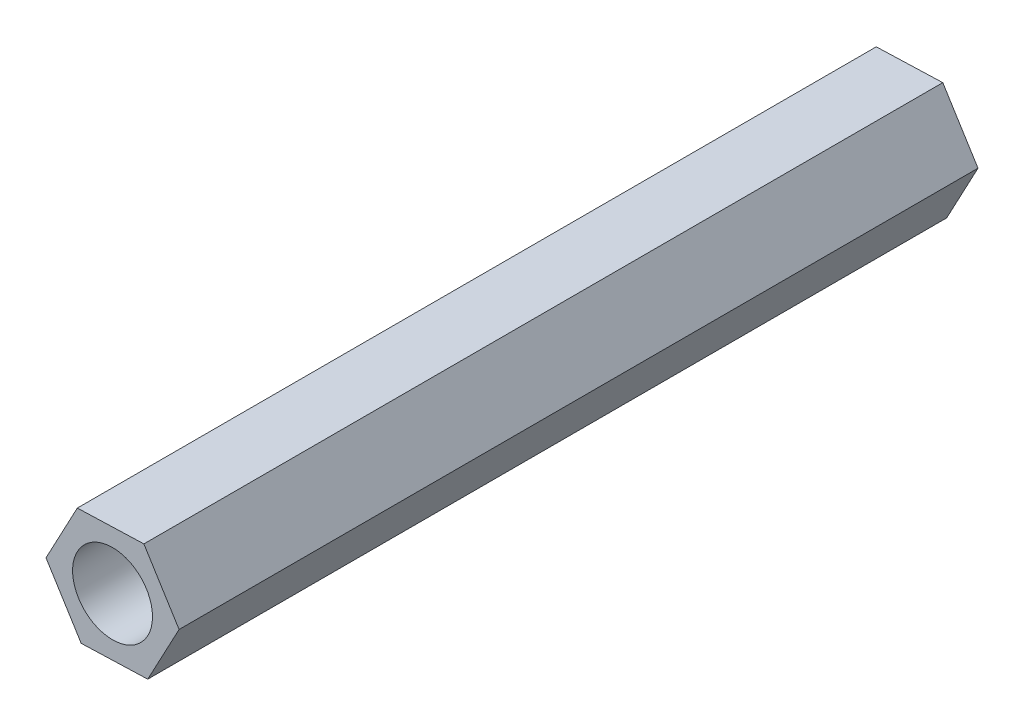
ISO-10303-21;
HEADER;
FILE_DESCRIPTION(('STEP AP214'),'2;1');
FILE_NAME('part.step','',(''),(''),'','','');
FILE_SCHEMA(('AUTOMOTIVE_DESIGN { 1 0 10303 214 1 1 1 1 }'));
ENDSEC;
DATA;
#1=APPLICATION_CONTEXT('core data for automotive mechanical design processes');
#2=APPLICATION_PROTOCOL_DEFINITION('international standard','automotive_design',2000,#1);
#3=PRODUCT_CONTEXT('',#1,'mechanical');
#4=PRODUCT('Part','Part','',(#3));
#5=PRODUCT_RELATED_PRODUCT_CATEGORY('part','',(#4));
#6=PRODUCT_DEFINITION_FORMATION('','',#4);
#7=PRODUCT_DEFINITION_CONTEXT('part definition',#1,'design');
#8=PRODUCT_DEFINITION('design','',#6,#7);
#9=PRODUCT_DEFINITION_SHAPE('','',#8);
#10=(LENGTH_UNIT() NAMED_UNIT(*) SI_UNIT(.MILLI.,.METRE.));
#11=(NAMED_UNIT(*) PLANE_ANGLE_UNIT() SI_UNIT($,.RADIAN.));
#12=(NAMED_UNIT(*) SI_UNIT($,.STERADIAN.) SOLID_ANGLE_UNIT());
#13=UNCERTAINTY_MEASURE_WITH_UNIT(LENGTH_MEASURE(1.E-05),#10,'distance_accuracy_value','');
#14=(GEOMETRIC_REPRESENTATION_CONTEXT(3) GLOBAL_UNCERTAINTY_ASSIGNED_CONTEXT((#13)) GLOBAL_UNIT_ASSIGNED_CONTEXT((#10,
#11,#12)) REPRESENTATION_CONTEXT('',''));
#15=CARTESIAN_POINT('',(0.,0.,0.));
#16=DIRECTION('',(0.,0.,1.));
#17=DIRECTION('',(1.,0.,0.));
#18=AXIS2_PLACEMENT_3D('',#15,#16,#17);
#19=CARTESIAN_POINT('',(0.,0.,60.));
#20=DIRECTION('',(0.,0.,1.));
#21=DIRECTION('',(1.,0.,0.));
#22=AXIS2_PLACEMENT_3D('',#19,#20,#21);
#23=PLANE('',#22);
#24=DIRECTION('',(0.999438069219738,0.0335193346342409,0.));
#25=VECTOR('',#24,1.);
#26=CARTESIAN_POINT('',(-2.35345219649332,-4.41149212385342,60.));
#27=LINE('',#26,#25);
#28=CARTESIAN_POINT('',(-2.35345219649332,-4.41149212385342,60.));
#29=VERTEX_POINT('',#28);
#30=CARTESIAN_POINT('',(2.64373814960536,-4.24389545068221,60.));
#31=VERTEX_POINT('',#30);
#32=EDGE_CURVE('E150',#29,#31,#27,.T.);
#33=ORIENTED_EDGE('',*,*,#32,.T.);
#34=DIRECTION('',(0.470690439298665,0.882298424770684,0.));
#35=VECTOR('',#34,1.);
#36=CARTESIAN_POINT('',(2.64373814960536,-4.24389545068221,60.));
#37=LINE('',#36,#35);
#38=CARTESIAN_POINT('',(4.99719034609869,0.167596673171203,60.));
#39=VERTEX_POINT('',#38);
#40=EDGE_CURVE('E108',#31,#39,#37,.T.);
#41=ORIENTED_EDGE('',*,*,#40,.T.);
#42=DIRECTION('',(-0.528747629921073,0.848779090136443,0.));
#43=VECTOR('',#42,1.);
#44=CARTESIAN_POINT('',(4.99719034609869,0.167596673171203,60.));
#45=LINE('',#44,#43);
#46=CARTESIAN_POINT('',(2.35345219649333,4.41149212385342,60.));
#47=VERTEX_POINT('',#46);
#48=EDGE_CURVE('E121',#39,#47,#45,.T.);
#49=ORIENTED_EDGE('',*,*,#48,.T.);
#50=DIRECTION('',(-0.999438069219738,-0.0335193346342406,0.));
#51=VECTOR('',#50,1.);
#52=CARTESIAN_POINT('',(2.35345219649333,4.41149212385342,60.));
#53=LINE('',#52,#51);
#54=CARTESIAN_POINT('',(-2.64373814960536,4.24389545068221,60.));
#55=VERTEX_POINT('',#54);
#56=EDGE_CURVE('E115',#47,#55,#53,.T.);
#57=ORIENTED_EDGE('',*,*,#56,.T.);
#58=DIRECTION('',(-0.470690439298665,-0.882298424770684,0.));
#59=VECTOR('',#58,1.);
#60=CARTESIAN_POINT('',(-2.64373814960536,4.24389545068221,60.));
#61=LINE('',#60,#59);
#62=CARTESIAN_POINT('',(-4.99719034609868,-0.167596673171203,60.));
#63=VERTEX_POINT('',#62);
#64=EDGE_CURVE('E119',#55,#63,#61,.T.);
#65=ORIENTED_EDGE('',*,*,#64,.T.);
#66=DIRECTION('',(0.528747629921073,-0.848779090136443,0.));
#67=VECTOR('',#66,1.);
#68=CARTESIAN_POINT('',(-4.99719034609868,-0.167596673171203,60.));
#69=LINE('',#68,#67);
#70=EDGE_CURVE('E71',#63,#29,#69,.T.);
#71=ORIENTED_EDGE('',*,*,#70,.T.);
#72=EDGE_LOOP('',(#33,#41,#49,#57,#65,#71));
#73=FACE_BOUND('',#72,.T.);
#74=CARTESIAN_POINT('',(0.,0.,60.));
#75=DIRECTION('',(0.,0.,1.));
#76=DIRECTION('',(1.,0.,0.));
#77=AXIS2_PLACEMENT_3D('',#74,#75,#76);
#78=CIRCLE('',#77,3.);
#79=CARTESIAN_POINT('',(3.,0.,60.));
#80=VERTEX_POINT('',#79);
#81=EDGE_CURVE('E143',#80,#80,#78,.T.);
#82=ORIENTED_EDGE('',*,*,#81,.F.);
#83=EDGE_LOOP('',(#82));
#84=FACE_BOUND('',#83,.T.);
#85=ADVANCED_FACE('F54',(#73,#84),#23,.T.);
#86=CARTESIAN_POINT('',(0.,0.,0.));
#87=DIRECTION('',(0.,0.,1.));
#88=DIRECTION('',(1.,0.,0.));
#89=AXIS2_PLACEMENT_3D('',#86,#87,#88);
#90=PLANE('',#89);
#91=DIRECTION('',(0.999438069219738,0.0335193346342409,0.));
#92=VECTOR('',#91,1.);
#93=CARTESIAN_POINT('',(-2.35345219649332,-4.41149212385342,0.));
#94=LINE('',#93,#92);
#95=CARTESIAN_POINT('',(-2.35345219649332,-4.41149212385342,0.));
#96=VERTEX_POINT('',#95);
#97=CARTESIAN_POINT('',(2.64373814960536,-4.24389545068221,0.));
#98=VERTEX_POINT('',#97);
#99=EDGE_CURVE('E139',#96,#98,#94,.T.);
#100=ORIENTED_EDGE('',*,*,#99,.F.);
#101=DIRECTION('',(0.528747629921073,-0.848779090136443,0.));
#102=VECTOR('',#101,1.);
#103=CARTESIAN_POINT('',(-4.99719034609868,-0.167596673171203,0.));
#104=LINE('',#103,#102);
#105=CARTESIAN_POINT('',(-4.99719034609868,-0.167596673171203,0.));
#106=VERTEX_POINT('',#105);
#107=EDGE_CURVE('E100',#106,#96,#104,.T.);
#108=ORIENTED_EDGE('',*,*,#107,.F.);
#109=DIRECTION('',(-0.470690439298665,-0.882298424770684,0.));
#110=VECTOR('',#109,1.);
#111=CARTESIAN_POINT('',(-2.64373814960536,4.24389545068221,0.));
#112=LINE('',#111,#110);
#113=CARTESIAN_POINT('',(-2.64373814960536,4.24389545068221,0.));
#114=VERTEX_POINT('',#113);
#115=EDGE_CURVE('E94',#114,#106,#112,.T.);
#116=ORIENTED_EDGE('',*,*,#115,.F.);
#117=DIRECTION('',(-0.999438069219738,-0.0335193346342406,0.));
#118=VECTOR('',#117,1.);
#119=CARTESIAN_POINT('',(2.35345219649333,4.41149212385342,0.));
#120=LINE('',#119,#118);
#121=CARTESIAN_POINT('',(2.35345219649333,4.41149212385342,0.));
#122=VERTEX_POINT('',#121);
#123=EDGE_CURVE('E129',#122,#114,#120,.T.);
#124=ORIENTED_EDGE('',*,*,#123,.F.);
#125=DIRECTION('',(-0.528747629921073,0.848779090136443,0.));
#126=VECTOR('',#125,1.);
#127=CARTESIAN_POINT('',(4.99719034609869,0.167596673171203,0.));
#128=LINE('',#127,#126);
#129=CARTESIAN_POINT('',(4.99719034609869,0.167596673171203,0.));
#130=VERTEX_POINT('',#129);
#131=EDGE_CURVE('E145',#130,#122,#128,.T.);
#132=ORIENTED_EDGE('',*,*,#131,.F.);
#133=DIRECTION('',(0.470690439298665,0.882298424770684,0.));
#134=VECTOR('',#133,1.);
#135=CARTESIAN_POINT('',(2.64373814960536,-4.24389545068221,0.));
#136=LINE('',#135,#134);
#137=EDGE_CURVE('E142',#98,#130,#136,.T.);
#138=ORIENTED_EDGE('',*,*,#137,.F.);
#139=EDGE_LOOP('',(#100,#108,#116,#124,#132,#138));
#140=FACE_BOUND('',#139,.T.);
#141=CARTESIAN_POINT('',(0.,0.,0.));
#142=DIRECTION('',(0.,0.,1.));
#143=DIRECTION('',(1.,0.,0.));
#144=AXIS2_PLACEMENT_3D('',#141,#142,#143);
#145=CIRCLE('',#144,3.);
#146=CARTESIAN_POINT('',(3.,0.,0.));
#147=VERTEX_POINT('',#146);
#148=EDGE_CURVE('E243',#147,#147,#145,.T.);
#149=ORIENTED_EDGE('',*,*,#148,.T.);
#150=EDGE_LOOP('',(#149));
#151=FACE_BOUND('',#150,.T.);
#152=ADVANCED_FACE('F159',(#140,#151),#90,.F.);
#153=CARTESIAN_POINT('',(-2.35345219649332,-4.41149212385342,60.));
#154=DIRECTION('',(-0.0335193346342409,0.999438069219738,0.));
#155=DIRECTION('',(-0.999438069219738,-0.0335193346342409,0.));
#156=AXIS2_PLACEMENT_3D('',#153,#154,#155);
#157=PLANE('',#156);
#158=ORIENTED_EDGE('',*,*,#99,.T.);
#159=DIRECTION('',(0.,0.,-1.));
#160=VECTOR('',#159,1.);
#161=CARTESIAN_POINT('',(2.64373814960536,-4.24389545068221,60.));
#162=LINE('',#161,#160);
#163=EDGE_CURVE('E12',#31,#98,#162,.T.);
#164=ORIENTED_EDGE('',*,*,#163,.F.);
#165=ORIENTED_EDGE('',*,*,#32,.F.);
#166=DIRECTION('',(0.,0.,-1.));
#167=VECTOR('',#166,1.);
#168=CARTESIAN_POINT('',(-2.35345219649332,-4.41149212385342,60.));
#169=LINE('',#168,#167);
#170=EDGE_CURVE('E135',#29,#96,#169,.T.);
#171=ORIENTED_EDGE('',*,*,#170,.T.);
#172=EDGE_LOOP('',(#158,#164,#165,#171));
#173=FACE_BOUND('',#172,.T.);
#174=ADVANCED_FACE('F56',(#173),#157,.F.);
#175=CARTESIAN_POINT('',(2.64373814960536,-4.24389545068221,60.));
#176=DIRECTION('',(-0.882298424770684,0.470690439298665,0.));
#177=DIRECTION('',(-0.470690439298665,-0.882298424770684,0.));
#178=AXIS2_PLACEMENT_3D('',#175,#176,#177);
#179=PLANE('',#178);
#180=ORIENTED_EDGE('',*,*,#137,.T.);
#181=DIRECTION('',(0.,0.,-1.));
#182=VECTOR('',#181,1.);
#183=CARTESIAN_POINT('',(4.99719034609869,0.167596673171203,60.));
#184=LINE('',#183,#182);
#185=EDGE_CURVE('E63',#39,#130,#184,.T.);
#186=ORIENTED_EDGE('',*,*,#185,.F.);
#187=ORIENTED_EDGE('',*,*,#40,.F.);
#188=ORIENTED_EDGE('',*,*,#163,.T.);
#189=EDGE_LOOP('',(#180,#186,#187,#188));
#190=FACE_BOUND('',#189,.T.);
#191=ADVANCED_FACE('F184',(#190),#179,.F.);
#192=CARTESIAN_POINT('',(4.99719034609869,0.167596673171203,60.));
#193=DIRECTION('',(-0.848779090136443,-0.528747629921073,0.));
#194=DIRECTION('',(0.528747629921073,-0.848779090136443,0.));
#195=AXIS2_PLACEMENT_3D('',#192,#193,#194);
#196=PLANE('',#195);
#197=ORIENTED_EDGE('',*,*,#131,.T.);
#198=DIRECTION('',(0.,0.,-1.));
#199=VECTOR('',#198,1.);
#200=CARTESIAN_POINT('',(2.35345219649333,4.41149212385342,60.));
#201=LINE('',#200,#199);
#202=EDGE_CURVE('E130',#47,#122,#201,.T.);
#203=ORIENTED_EDGE('',*,*,#202,.F.);
#204=ORIENTED_EDGE('',*,*,#48,.F.);
#205=ORIENTED_EDGE('',*,*,#185,.T.);
#206=EDGE_LOOP('',(#197,#203,#204,#205));
#207=FACE_BOUND('',#206,.T.);
#208=ADVANCED_FACE('F156',(#207),#196,.F.);
#209=CARTESIAN_POINT('',(2.35345219649333,4.41149212385342,60.));
#210=DIRECTION('',(0.0335193346342406,-0.999438069219738,0.));
#211=DIRECTION('',(0.999438069219738,0.0335193346342406,0.));
#212=AXIS2_PLACEMENT_3D('',#209,#210,#211);
#213=PLANE('',#212);
#214=ORIENTED_EDGE('',*,*,#123,.T.);
#215=DIRECTION('',(0.,0.,-1.));
#216=VECTOR('',#215,1.);
#217=CARTESIAN_POINT('',(-2.64373814960536,4.24389545068221,60.));
#218=LINE('',#217,#216);
#219=EDGE_CURVE('E126',#55,#114,#218,.T.);
#220=ORIENTED_EDGE('',*,*,#219,.F.);
#221=ORIENTED_EDGE('',*,*,#56,.F.);
#222=ORIENTED_EDGE('',*,*,#202,.T.);
#223=EDGE_LOOP('',(#214,#220,#221,#222));
#224=FACE_BOUND('',#223,.T.);
#225=ADVANCED_FACE('F127',(#224),#213,.F.);
#226=CARTESIAN_POINT('',(-2.64373814960536,4.24389545068221,60.));
#227=DIRECTION('',(0.882298424770684,-0.470690439298665,0.));
#228=DIRECTION('',(0.470690439298665,0.882298424770684,0.));
#229=AXIS2_PLACEMENT_3D('',#226,#227,#228);
#230=PLANE('',#229);
#231=ORIENTED_EDGE('',*,*,#115,.T.);
#232=DIRECTION('',(0.,0.,-1.));
#233=VECTOR('',#232,1.);
#234=CARTESIAN_POINT('',(-4.99719034609868,-0.167596673171203,60.));
#235=LINE('',#234,#233);
#236=EDGE_CURVE('E131',#63,#106,#235,.T.);
#237=ORIENTED_EDGE('',*,*,#236,.F.);
#238=ORIENTED_EDGE('',*,*,#64,.F.);
#239=ORIENTED_EDGE('',*,*,#219,.T.);
#240=EDGE_LOOP('',(#231,#237,#238,#239));
#241=FACE_BOUND('',#240,.T.);
#242=ADVANCED_FACE('F133',(#241),#230,.F.);
#243=CARTESIAN_POINT('',(-4.99719034609868,-0.167596673171203,60.));
#244=DIRECTION('',(0.848779090136443,0.528747629921073,0.));
#245=DIRECTION('',(-0.528747629921073,0.848779090136443,0.));
#246=AXIS2_PLACEMENT_3D('',#243,#244,#245);
#247=PLANE('',#246);
#248=ORIENTED_EDGE('',*,*,#107,.T.);
#249=ORIENTED_EDGE('',*,*,#170,.F.);
#250=ORIENTED_EDGE('',*,*,#70,.F.);
#251=ORIENTED_EDGE('',*,*,#236,.T.);
#252=EDGE_LOOP('',(#248,#249,#250,#251));
#253=FACE_BOUND('',#252,.T.);
#254=ADVANCED_FACE('F164',(#253),#247,.F.);
#255=CARTESIAN_POINT('',(0.,0.,60.));
#256=DIRECTION('',(0.,0.,-1.));
#257=DIRECTION('',(-1.,0.,0.));
#258=AXIS2_PLACEMENT_3D('',#255,#256,#257);
#259=CYLINDRICAL_SURFACE('',#258,3.);
#260=ORIENTED_EDGE('',*,*,#81,.T.);
#261=EDGE_LOOP('',(#260));
#262=FACE_BOUND('',#261,.T.);
#263=ORIENTED_EDGE('',*,*,#148,.F.);
#264=EDGE_LOOP('',(#263));
#265=FACE_BOUND('',#264,.T.);
#266=ADVANCED_FACE('F166',(#262,#265),#259,.F.);
#267=CLOSED_SHELL('',(#85,#152,#174,#191,#208,#225,#242,#254,#266));
#268=MANIFOLD_SOLID_BREP('B2',#267);
#269=ADVANCED_BREP_SHAPE_REPRESENTATION('',(#18,#268),#14);
#270=SHAPE_DEFINITION_REPRESENTATION(#9,#269);
ENDSEC;
END-ISO-10303-21;
